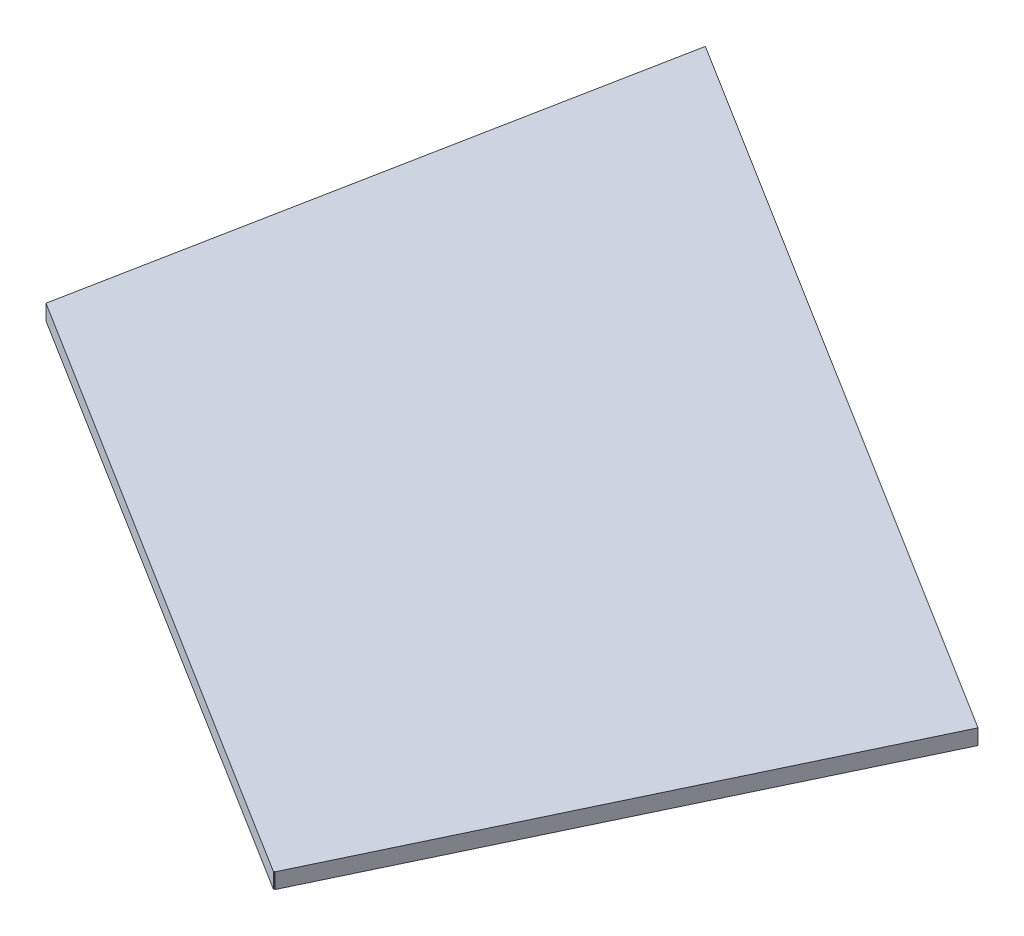
ISO-10303-21;
HEADER;
FILE_DESCRIPTION(('STEP AP214'),'2;1');
FILE_NAME('part.step','',(''),(''),'','','');
FILE_SCHEMA(('AUTOMOTIVE_DESIGN { 1 0 10303 214 1 1 1 1 }'));
ENDSEC;
DATA;
#1=APPLICATION_CONTEXT('core data for automotive mechanical design processes');
#2=APPLICATION_PROTOCOL_DEFINITION('international standard','automotive_design',2000,#1);
#3=PRODUCT_CONTEXT('',#1,'mechanical');
#4=PRODUCT('Part','Part','',(#3));
#5=PRODUCT_RELATED_PRODUCT_CATEGORY('part','',(#4));
#6=PRODUCT_DEFINITION_FORMATION('','',#4);
#7=PRODUCT_DEFINITION_CONTEXT('part definition',#1,'design');
#8=PRODUCT_DEFINITION('design','',#6,#7);
#9=PRODUCT_DEFINITION_SHAPE('','',#8);
#10=(LENGTH_UNIT() NAMED_UNIT(*) SI_UNIT(.MILLI.,.METRE.));
#11=(NAMED_UNIT(*) PLANE_ANGLE_UNIT() SI_UNIT($,.RADIAN.));
#12=(NAMED_UNIT(*) SI_UNIT($,.STERADIAN.) SOLID_ANGLE_UNIT());
#13=UNCERTAINTY_MEASURE_WITH_UNIT(LENGTH_MEASURE(1.E-05),#10,'distance_accuracy_value','');
#14=(GEOMETRIC_REPRESENTATION_CONTEXT(3) GLOBAL_UNCERTAINTY_ASSIGNED_CONTEXT((#13)) GLOBAL_UNIT_ASSIGNED_CONTEXT((#10,
#11,#12)) REPRESENTATION_CONTEXT('',''));
#15=CARTESIAN_POINT('',(0.,0.,0.));
#16=DIRECTION('',(0.,0.,1.));
#17=DIRECTION('',(1.,0.,0.));
#18=AXIS2_PLACEMENT_3D('',#15,#16,#17);
#19=CARTESIAN_POINT('',(0.,2.,0.));
#20=DIRECTION('',(0.529837232803973,0.,-0.84809934956621));
#21=DIRECTION('',(-0.84809934956621,0.,-0.529837232803973));
#22=AXIS2_PLACEMENT_3D('',#19,#20,#21);
#23=PLANE('',#22);
#24=DIRECTION('',(0.84809934956621,0.,0.529837232803973));
#25=VECTOR('',#24,1.);
#26=CARTESIAN_POINT('',(0.,0.,0.));
#27=LINE('',#26,#25);
#28=CARTESIAN_POINT('',(0.,0.,0.));
#29=VERTEX_POINT('',#28);
#30=CARTESIAN_POINT('',(78.8824221482843,0.,49.280599365274));
#31=VERTEX_POINT('',#30);
#32=EDGE_CURVE('E128',#29,#31,#27,.T.);
#33=ORIENTED_EDGE('',*,*,#32,.T.);
#34=DIRECTION('',(0.,-1.,0.));
#35=VECTOR('',#34,1.);
#36=CARTESIAN_POINT('',(78.8824221482843,2.,49.280599365274));
#37=LINE('',#36,#35);
#38=CARTESIAN_POINT('',(78.8824221482843,2.,49.280599365274));
#39=VERTEX_POINT('',#38);
#40=EDGE_CURVE('E11',#39,#31,#37,.T.);
#41=ORIENTED_EDGE('',*,*,#40,.F.);
#42=DIRECTION('',(0.84809934956621,0.,0.529837232803973));
#43=VECTOR('',#42,1.);
#44=CARTESIAN_POINT('',(0.,2.,0.));
#45=LINE('',#44,#43);
#46=CARTESIAN_POINT('',(0.,2.,0.));
#47=VERTEX_POINT('',#46);
#48=EDGE_CURVE('E144',#47,#39,#45,.T.);
#49=ORIENTED_EDGE('',*,*,#48,.F.);
#50=DIRECTION('',(0.,-1.,0.));
#51=VECTOR('',#50,1.);
#52=CARTESIAN_POINT('',(0.,2.,0.));
#53=LINE('',#52,#51);
#54=EDGE_CURVE('E124',#47,#29,#53,.T.);
#55=ORIENTED_EDGE('',*,*,#54,.T.);
#56=EDGE_LOOP('',(#33,#41,#49,#55));
#57=FACE_BOUND('',#56,.T.);
#58=ADVANCED_FACE('F39',(#57),#23,.F.);
#59=CARTESIAN_POINT('',(78.8824221482843,2.,49.280599365274));
#60=DIRECTION('',(-0.913865969483732,0.,-0.406015996999574));
#61=DIRECTION('',(-0.406015996999574,0.,0.913865969483732));
#62=AXIS2_PLACEMENT_3D('',#59,#60,#61);
#63=PLANE('',#62);
#64=DIRECTION('',(0.406015996999574,0.,-0.913865969483732));
#65=VECTOR('',#64,1.);
#66=CARTESIAN_POINT('',(78.8824221482843,0.,49.280599365274));
#67=LINE('',#66,#65);
#68=CARTESIAN_POINT('',(78.9323450016386,0.,49.1682323720591));
#69=VERTEX_POINT('',#68);
#70=EDGE_CURVE('E132',#31,#69,#67,.T.);
#71=ORIENTED_EDGE('',*,*,#70,.T.);
#72=DIRECTION('',(0.,-1.,0.));
#73=VECTOR('',#72,1.);
#74=CARTESIAN_POINT('',(78.9323450016386,2.,49.1682323720591));
#75=LINE('',#74,#73);
#76=CARTESIAN_POINT('',(78.9323450016386,2.,49.1682323720591));
#77=VERTEX_POINT('',#76);
#78=EDGE_CURVE('E48',#77,#69,#75,.T.);
#79=ORIENTED_EDGE('',*,*,#78,.F.);
#80=DIRECTION('',(0.406015996999574,0.,-0.913865969483732));
#81=VECTOR('',#80,1.);
#82=CARTESIAN_POINT('',(78.8824221482843,2.,49.280599365274));
#83=LINE('',#82,#81);
#84=EDGE_CURVE('E93',#39,#77,#83,.T.);
#85=ORIENTED_EDGE('',*,*,#84,.F.);
#86=ORIENTED_EDGE('',*,*,#40,.T.);
#87=EDGE_LOOP('',(#71,#79,#85,#86));
#88=FACE_BOUND('',#87,.T.);
#89=ADVANCED_FACE('F172',(#88),#63,.F.);
#90=CARTESIAN_POINT('',(78.9323450016386,2.,49.1682323720591));
#91=DIRECTION('',(0.52919757336426,0.,-0.848498631905426));
#92=DIRECTION('',(-0.848498631905426,0.,-0.52919757336426));
#93=AXIS2_PLACEMENT_3D('',#90,#91,#92);
#94=PLANE('',#93);
#95=DIRECTION('',(0.848498631905426,0.,0.52919757336426));
#96=VECTOR('',#95,1.);
#97=CARTESIAN_POINT('',(78.9323450016386,0.,49.1682323720591));
#98=LINE('',#97,#96);
#99=CARTESIAN_POINT('',(79.0216741840287,0.,49.2239458225868));
#100=VERTEX_POINT('',#99);
#101=EDGE_CURVE('E135',#69,#100,#98,.T.);
#102=ORIENTED_EDGE('',*,*,#101,.T.);
#103=DIRECTION('',(0.,-1.,0.));
#104=VECTOR('',#103,1.);
#105=CARTESIAN_POINT('',(79.0216741840287,2.,49.2239458225868));
#106=LINE('',#105,#104);
#107=CARTESIAN_POINT('',(79.0216741840287,2.,49.2239458225868));
#108=VERTEX_POINT('',#107);
#109=EDGE_CURVE('E117',#108,#100,#106,.T.);
#110=ORIENTED_EDGE('',*,*,#109,.F.);
#111=DIRECTION('',(0.848498631905426,0.,0.52919757336426));
#112=VECTOR('',#111,1.);
#113=CARTESIAN_POINT('',(78.9323450016386,2.,49.1682323720591));
#114=LINE('',#113,#112);
#115=EDGE_CURVE('E106',#77,#108,#114,.T.);
#116=ORIENTED_EDGE('',*,*,#115,.F.);
#117=ORIENTED_EDGE('',*,*,#78,.T.);
#118=EDGE_LOOP('',(#102,#110,#116,#117));
#119=FACE_BOUND('',#118,.T.);
#120=ADVANCED_FACE('F154',(#119),#94,.F.);
#121=CARTESIAN_POINT('',(79.0216741840287,2.,49.2239458225868));
#122=DIRECTION('',(-0.90285151427835,0.,-0.429952489427949));
#123=DIRECTION('',(-0.429952489427949,0.,0.90285151427835));
#124=AXIS2_PLACEMENT_3D('',#121,#122,#123);
#125=PLANE('',#124);
#126=DIRECTION('',(0.429952489427949,0.,-0.90285151427835));
#127=VECTOR('',#126,1.);
#128=CARTESIAN_POINT('',(79.0216741840287,0.,49.2239458225868));
#129=LINE('',#128,#127);
#130=CARTESIAN_POINT('',(108.555181003153,0.,-12.7930723578955));
#131=VERTEX_POINT('',#130);
#132=EDGE_CURVE('E115',#100,#131,#129,.T.);
#133=ORIENTED_EDGE('',*,*,#132,.T.);
#134=DIRECTION('',(0.,-1.,0.));
#135=VECTOR('',#134,1.);
#136=CARTESIAN_POINT('',(108.555181003153,2.,-12.7930723578955));
#137=LINE('',#136,#135);
#138=CARTESIAN_POINT('',(108.555181003153,2.,-12.7930723578955));
#139=VERTEX_POINT('',#138);
#140=EDGE_CURVE('E112',#139,#131,#137,.T.);
#141=ORIENTED_EDGE('',*,*,#140,.F.);
#142=DIRECTION('',(0.429952489427949,0.,-0.90285151427835));
#143=VECTOR('',#142,1.);
#144=CARTESIAN_POINT('',(79.0216741840287,2.,49.2239458225868));
#145=LINE('',#144,#143);
#146=EDGE_CURVE('E100',#108,#139,#145,.T.);
#147=ORIENTED_EDGE('',*,*,#146,.F.);
#148=ORIENTED_EDGE('',*,*,#109,.T.);
#149=EDGE_LOOP('',(#133,#141,#147,#148));
#150=FACE_BOUND('',#149,.T.);
#151=ADVANCED_FACE('F113',(#150),#125,.F.);
#152=CARTESIAN_POINT('',(108.555181003153,2.,-12.7930723578955));
#153=DIRECTION('',(-0.529837232803975,0.,0.848099349566209));
#154=DIRECTION('',(0.848099349566209,0.,0.529837232803975));
#155=AXIS2_PLACEMENT_3D('',#152,#153,#154);
#156=PLANE('',#155);
#157=DIRECTION('',(-0.848099349566209,0.,-0.529837232803975));
#158=VECTOR('',#157,1.);
#159=CARTESIAN_POINT('',(108.555181003153,0.,-12.7930723578955));
#160=LINE('',#159,#158);
#161=CARTESIAN_POINT('',(13.9703863505384,0.,-71.8834912925482));
#162=VERTEX_POINT('',#161);
#163=EDGE_CURVE('E79',#131,#162,#160,.T.);
#164=ORIENTED_EDGE('',*,*,#163,.T.);
#165=DIRECTION('',(0.,-1.,0.));
#166=VECTOR('',#165,1.);
#167=CARTESIAN_POINT('',(13.9703863505384,2.,-71.8834912925482));
#168=LINE('',#167,#166);
#169=CARTESIAN_POINT('',(13.9703863505384,2.,-71.8834912925482));
#170=VERTEX_POINT('',#169);
#171=EDGE_CURVE('E118',#170,#162,#168,.T.);
#172=ORIENTED_EDGE('',*,*,#171,.F.);
#173=DIRECTION('',(-0.848099349566209,0.,-0.529837232803975));
#174=VECTOR('',#173,1.);
#175=CARTESIAN_POINT('',(108.555181003153,2.,-12.7930723578955));
#176=LINE('',#175,#174);
#177=EDGE_CURVE('E104',#139,#170,#176,.T.);
#178=ORIENTED_EDGE('',*,*,#177,.F.);
#179=ORIENTED_EDGE('',*,*,#140,.T.);
#180=EDGE_LOOP('',(#164,#172,#178,#179));
#181=FACE_BOUND('',#180,.T.);
#182=ADVANCED_FACE('F120',(#181),#156,.F.);
#183=CARTESIAN_POINT('',(13.9703863505384,2.,-71.8834912925482));
#184=DIRECTION('',(0.981633190984925,0.,0.190778086678616));
#185=DIRECTION('',(0.190778086678616,0.,-0.981633190984925));
#186=AXIS2_PLACEMENT_3D('',#183,#184,#185);
#187=PLANE('',#186);
#188=DIRECTION('',(-0.190778086678616,0.,0.981633190984925));
#189=VECTOR('',#188,1.);
#190=CARTESIAN_POINT('',(13.9703863505384,0.,-71.8834912925482));
#191=LINE('',#190,#189);
#192=EDGE_CURVE('E85',#162,#29,#191,.T.);
#193=ORIENTED_EDGE('',*,*,#192,.T.);
#194=ORIENTED_EDGE('',*,*,#54,.F.);
#195=DIRECTION('',(-0.190778086678616,0.,0.981633190984925));
#196=VECTOR('',#195,1.);
#197=CARTESIAN_POINT('',(13.9703863505384,2.,-71.8834912925482));
#198=LINE('',#197,#196);
#199=EDGE_CURVE('E56',#170,#47,#198,.T.);
#200=ORIENTED_EDGE('',*,*,#199,.F.);
#201=ORIENTED_EDGE('',*,*,#171,.T.);
#202=EDGE_LOOP('',(#193,#194,#200,#201));
#203=FACE_BOUND('',#202,.T.);
#204=ADVANCED_FACE('F161',(#203),#187,.F.);
#205=CARTESIAN_POINT('',(0.,2.,0.));
#206=DIRECTION('',(0.,1.,0.));
#207=DIRECTION('',(0.,0.,1.));
#208=AXIS2_PLACEMENT_3D('',#205,#206,#207);
#209=PLANE('',#208);
#210=ORIENTED_EDGE('',*,*,#48,.T.);
#211=ORIENTED_EDGE('',*,*,#84,.T.);
#212=ORIENTED_EDGE('',*,*,#115,.T.);
#213=ORIENTED_EDGE('',*,*,#146,.T.);
#214=ORIENTED_EDGE('',*,*,#177,.T.);
#215=ORIENTED_EDGE('',*,*,#199,.T.);
#216=EDGE_LOOP('',(#210,#211,#212,#213,#214,#215));
#217=FACE_BOUND('',#216,.T.);
#218=ADVANCED_FACE('F102',(#217),#209,.T.);
#219=CARTESIAN_POINT('',(0.,0.,0.));
#220=DIRECTION('',(0.,1.,0.));
#221=DIRECTION('',(0.,0.,1.));
#222=AXIS2_PLACEMENT_3D('',#219,#220,#221);
#223=PLANE('',#222);
#224=ORIENTED_EDGE('',*,*,#32,.F.);
#225=ORIENTED_EDGE('',*,*,#192,.F.);
#226=ORIENTED_EDGE('',*,*,#163,.F.);
#227=ORIENTED_EDGE('',*,*,#132,.F.);
#228=ORIENTED_EDGE('',*,*,#101,.F.);
#229=ORIENTED_EDGE('',*,*,#70,.F.);
#230=EDGE_LOOP('',(#224,#225,#226,#227,#228,#229));
#231=FACE_BOUND('',#230,.T.);
#232=ADVANCED_FACE('F157',(#231),#223,.F.);
#233=CLOSED_SHELL('',(#58,#89,#120,#151,#182,#204,#218,#232));
#234=MANIFOLD_SOLID_BREP('B2',#233);
#235=ADVANCED_BREP_SHAPE_REPRESENTATION('',(#18,#234),#14);
#236=SHAPE_DEFINITION_REPRESENTATION(#9,#235);
ENDSEC;
END-ISO-10303-21;
